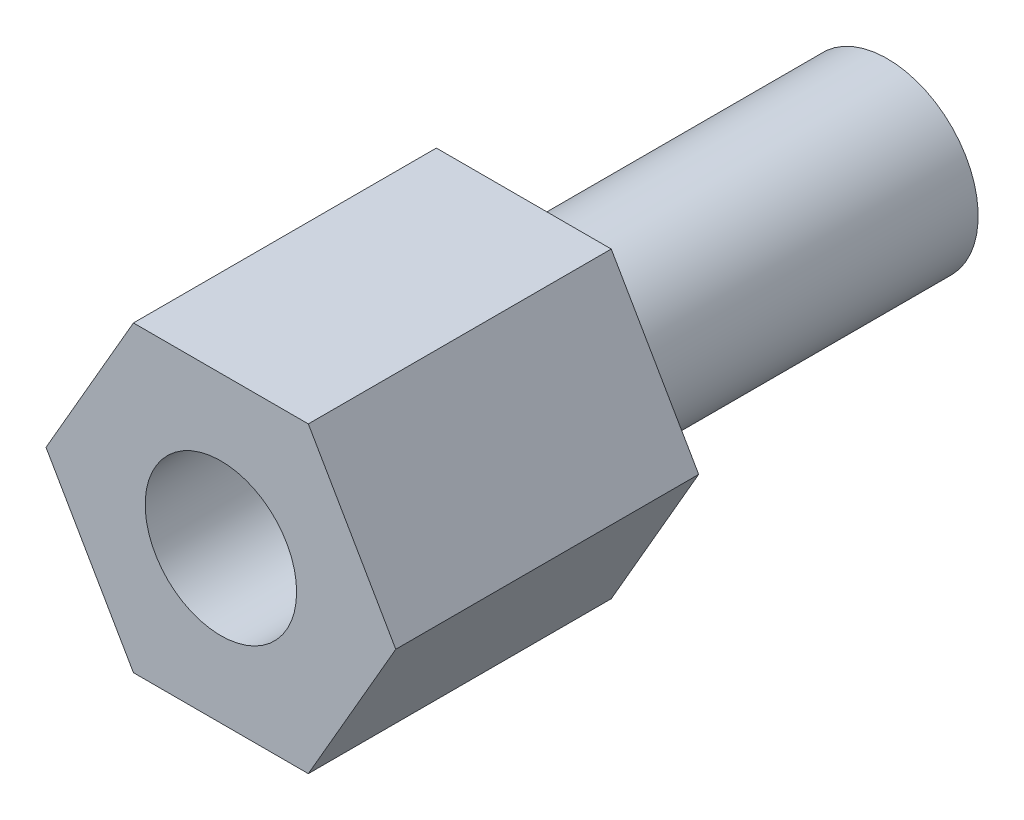
ISO-10303-21;
HEADER;
FILE_DESCRIPTION(('STEP AP214'),'2;1');
FILE_NAME('part.step','',(''),(''),'','','');
FILE_SCHEMA(('AUTOMOTIVE_DESIGN { 1 0 10303 214 1 1 1 1 }'));
ENDSEC;
DATA;
#1=APPLICATION_CONTEXT('core data for automotive mechanical design processes');
#2=APPLICATION_PROTOCOL_DEFINITION('international standard','automotive_design',2000,#1);
#3=PRODUCT_CONTEXT('',#1,'mechanical');
#4=PRODUCT('Part','Part','',(#3));
#5=PRODUCT_RELATED_PRODUCT_CATEGORY('part','',(#4));
#6=PRODUCT_DEFINITION_FORMATION('','',#4);
#7=PRODUCT_DEFINITION_CONTEXT('part definition',#1,'design');
#8=PRODUCT_DEFINITION('design','',#6,#7);
#9=PRODUCT_DEFINITION_SHAPE('','',#8);
#10=(LENGTH_UNIT() NAMED_UNIT(*) SI_UNIT(.MILLI.,.METRE.));
#11=(NAMED_UNIT(*) PLANE_ANGLE_UNIT() SI_UNIT($,.RADIAN.));
#12=(NAMED_UNIT(*) SI_UNIT($,.STERADIAN.) SOLID_ANGLE_UNIT());
#13=UNCERTAINTY_MEASURE_WITH_UNIT(LENGTH_MEASURE(1.E-05),#10,'distance_accuracy_value','');
#14=(GEOMETRIC_REPRESENTATION_CONTEXT(3) GLOBAL_UNCERTAINTY_ASSIGNED_CONTEXT((#13)) GLOBAL_UNIT_ASSIGNED_CONTEXT((#10,
#11,#12)) REPRESENTATION_CONTEXT('',''));
#15=CARTESIAN_POINT('',(0.,0.,0.));
#16=DIRECTION('',(0.,0.,1.));
#17=DIRECTION('',(1.,0.,0.));
#18=AXIS2_PLACEMENT_3D('',#15,#16,#17);
#19=CARTESIAN_POINT('',(1.44337567297406,2.5,5.));
#20=DIRECTION('',(0.,-1.,0.));
#21=DIRECTION('',(1.,0.,0.));
#22=AXIS2_PLACEMENT_3D('',#19,#20,#21);
#23=PLANE('',#22);
#24=DIRECTION('',(-1.,0.,0.));
#25=VECTOR('',#24,1.);
#26=CARTESIAN_POINT('',(1.44337567297406,2.5,0.));
#27=LINE('',#26,#25);
#28=CARTESIAN_POINT('',(1.44337567297406,2.5,0.));
#29=VERTEX_POINT('',#28);
#30=CARTESIAN_POINT('',(-1.44337567297407,2.5,0.));
#31=VERTEX_POINT('',#30);
#32=EDGE_CURVE('E124',#29,#31,#27,.T.);
#33=ORIENTED_EDGE('',*,*,#32,.T.);
#34=DIRECTION('',(0.,0.,-1.));
#35=VECTOR('',#34,1.);
#36=CARTESIAN_POINT('',(-1.44337567297407,2.5,5.));
#37=LINE('',#36,#35);
#38=CARTESIAN_POINT('',(-1.44337567297407,2.5,5.));
#39=VERTEX_POINT('',#38);
#40=EDGE_CURVE('E39',#39,#31,#37,.T.);
#41=ORIENTED_EDGE('',*,*,#40,.F.);
#42=DIRECTION('',(-1.,0.,0.));
#43=VECTOR('',#42,1.);
#44=CARTESIAN_POINT('',(1.44337567297406,2.5,5.));
#45=LINE('',#44,#43);
#46=CARTESIAN_POINT('',(1.44337567297406,2.5,5.));
#47=VERTEX_POINT('',#46);
#48=EDGE_CURVE('E135',#47,#39,#45,.T.);
#49=ORIENTED_EDGE('',*,*,#48,.F.);
#50=DIRECTION('',(0.,0.,-1.));
#51=VECTOR('',#50,1.);
#52=CARTESIAN_POINT('',(1.44337567297406,2.5,5.));
#53=LINE('',#52,#51);
#54=EDGE_CURVE('E120',#47,#29,#53,.T.);
#55=ORIENTED_EDGE('',*,*,#54,.T.);
#56=EDGE_LOOP('',(#33,#41,#49,#55));
#57=FACE_BOUND('',#56,.T.);
#58=ADVANCED_FACE('F36',(#57),#23,.F.);
#59=CARTESIAN_POINT('',(-1.44337567297407,2.5,5.));
#60=DIRECTION('',(0.866025403784439,-0.5,0.));
#61=DIRECTION('',(0.5,0.866025403784439,0.));
#62=AXIS2_PLACEMENT_3D('',#59,#60,#61);
#63=PLANE('',#62);
#64=DIRECTION('',(-0.5,-0.866025403784439,0.));
#65=VECTOR('',#64,1.);
#66=CARTESIAN_POINT('',(-1.44337567297407,2.5,0.));
#67=LINE('',#66,#65);
#68=CARTESIAN_POINT('',(-2.88675134594813,0.,0.));
#69=VERTEX_POINT('',#68);
#70=EDGE_CURVE('E127',#31,#69,#67,.T.);
#71=ORIENTED_EDGE('',*,*,#70,.T.);
#72=DIRECTION('',(0.,0.,-1.));
#73=VECTOR('',#72,1.);
#74=CARTESIAN_POINT('',(-2.88675134594813,0.,5.));
#75=LINE('',#74,#73);
#76=CARTESIAN_POINT('',(-2.88675134594813,0.,5.));
#77=VERTEX_POINT('',#76);
#78=EDGE_CURVE('E138',#77,#69,#75,.T.);
#79=ORIENTED_EDGE('',*,*,#78,.F.);
#80=DIRECTION('',(-0.5,-0.866025403784439,0.));
#81=VECTOR('',#80,1.);
#82=CARTESIAN_POINT('',(-1.44337567297407,2.5,5.));
#83=LINE('',#82,#81);
#84=EDGE_CURVE('E92',#39,#77,#83,.T.);
#85=ORIENTED_EDGE('',*,*,#84,.F.);
#86=ORIENTED_EDGE('',*,*,#40,.T.);
#87=EDGE_LOOP('',(#71,#79,#85,#86));
#88=FACE_BOUND('',#87,.T.);
#89=ADVANCED_FACE('F143',(#88),#63,.F.);
#90=CARTESIAN_POINT('',(-2.88675134594813,0.,5.));
#91=DIRECTION('',(0.866025403784438,0.5,0.));
#92=DIRECTION('',(-0.5,0.866025403784438,0.));
#93=AXIS2_PLACEMENT_3D('',#90,#91,#92);
#94=PLANE('',#93);
#95=DIRECTION('',(0.5,-0.866025403784438,0.));
#96=VECTOR('',#95,1.);
#97=CARTESIAN_POINT('',(-2.88675134594813,0.,0.));
#98=LINE('',#97,#96);
#99=CARTESIAN_POINT('',(-1.44337567297406,-2.5,0.));
#100=VERTEX_POINT('',#99);
#101=EDGE_CURVE('E130',#69,#100,#98,.T.);
#102=ORIENTED_EDGE('',*,*,#101,.T.);
#103=DIRECTION('',(0.,0.,-1.));
#104=VECTOR('',#103,1.);
#105=CARTESIAN_POINT('',(-1.44337567297406,-2.5,5.));
#106=LINE('',#105,#104);
#107=CARTESIAN_POINT('',(-1.44337567297406,-2.5,5.));
#108=VERTEX_POINT('',#107);
#109=EDGE_CURVE('E115',#108,#100,#106,.T.);
#110=ORIENTED_EDGE('',*,*,#109,.F.);
#111=DIRECTION('',(0.5,-0.866025403784438,0.));
#112=VECTOR('',#111,1.);
#113=CARTESIAN_POINT('',(-2.88675134594813,0.,5.));
#114=LINE('',#113,#112);
#115=EDGE_CURVE('E106',#77,#108,#114,.T.);
#116=ORIENTED_EDGE('',*,*,#115,.F.);
#117=ORIENTED_EDGE('',*,*,#78,.T.);
#118=EDGE_LOOP('',(#102,#110,#116,#117));
#119=FACE_BOUND('',#118,.T.);
#120=ADVANCED_FACE('F149',(#119),#94,.F.);
#121=CARTESIAN_POINT('',(-1.44337567297406,-2.5,5.));
#122=DIRECTION('',(0.,1.,0.));
#123=DIRECTION('',(-1.,0.,0.));
#124=AXIS2_PLACEMENT_3D('',#121,#122,#123);
#125=PLANE('',#124);
#126=DIRECTION('',(1.,0.,0.));
#127=VECTOR('',#126,1.);
#128=CARTESIAN_POINT('',(-1.44337567297406,-2.5,0.));
#129=LINE('',#128,#127);
#130=CARTESIAN_POINT('',(1.44337567297407,-2.5,0.));
#131=VERTEX_POINT('',#130);
#132=EDGE_CURVE('E114',#100,#131,#129,.T.);
#133=ORIENTED_EDGE('',*,*,#132,.T.);
#134=DIRECTION('',(0.,0.,-1.));
#135=VECTOR('',#134,1.);
#136=CARTESIAN_POINT('',(1.44337567297407,-2.5,5.));
#137=LINE('',#136,#135);
#138=CARTESIAN_POINT('',(1.44337567297407,-2.5,5.));
#139=VERTEX_POINT('',#138);
#140=EDGE_CURVE('E111',#139,#131,#137,.T.);
#141=ORIENTED_EDGE('',*,*,#140,.F.);
#142=DIRECTION('',(1.,0.,0.));
#143=VECTOR('',#142,1.);
#144=CARTESIAN_POINT('',(-1.44337567297406,-2.5,5.));
#145=LINE('',#144,#143);
#146=EDGE_CURVE('E100',#108,#139,#145,.T.);
#147=ORIENTED_EDGE('',*,*,#146,.F.);
#148=ORIENTED_EDGE('',*,*,#109,.T.);
#149=EDGE_LOOP('',(#133,#141,#147,#148));
#150=FACE_BOUND('',#149,.T.);
#151=ADVANCED_FACE('F112',(#150),#125,.F.);
#152=CARTESIAN_POINT('',(1.44337567297407,-2.5,5.));
#153=DIRECTION('',(-0.866025403784439,0.5,0.));
#154=DIRECTION('',(-0.5,-0.866025403784439,0.));
#155=AXIS2_PLACEMENT_3D('',#152,#153,#154);
#156=PLANE('',#155);
#157=DIRECTION('',(0.5,0.866025403784439,0.));
#158=VECTOR('',#157,1.);
#159=CARTESIAN_POINT('',(1.44337567297407,-2.5,0.));
#160=LINE('',#159,#158);
#161=CARTESIAN_POINT('',(2.88675134594813,0.,0.));
#162=VERTEX_POINT('',#161);
#163=EDGE_CURVE('E77',#131,#162,#160,.T.);
#164=ORIENTED_EDGE('',*,*,#163,.T.);
#165=DIRECTION('',(0.,0.,-1.));
#166=VECTOR('',#165,1.);
#167=CARTESIAN_POINT('',(2.88675134594813,0.,5.));
#168=LINE('',#167,#166);
#169=CARTESIAN_POINT('',(2.88675134594813,0.,5.));
#170=VERTEX_POINT('',#169);
#171=EDGE_CURVE('E116',#170,#162,#168,.T.);
#172=ORIENTED_EDGE('',*,*,#171,.F.);
#173=DIRECTION('',(0.5,0.866025403784439,0.));
#174=VECTOR('',#173,1.);
#175=CARTESIAN_POINT('',(1.44337567297407,-2.5,5.));
#176=LINE('',#175,#174);
#177=EDGE_CURVE('E104',#139,#170,#176,.T.);
#178=ORIENTED_EDGE('',*,*,#177,.F.);
#179=ORIENTED_EDGE('',*,*,#140,.T.);
#180=EDGE_LOOP('',(#164,#172,#178,#179));
#181=FACE_BOUND('',#180,.T.);
#182=ADVANCED_FACE('F118',(#181),#156,.F.);
#183=CARTESIAN_POINT('',(2.88675134594813,0.,5.));
#184=DIRECTION('',(-0.866025403784439,-0.5,0.));
#185=DIRECTION('',(0.5,-0.866025403784439,0.));
#186=AXIS2_PLACEMENT_3D('',#183,#184,#185);
#187=PLANE('',#186);
#188=DIRECTION('',(-0.5,0.866025403784439,0.));
#189=VECTOR('',#188,1.);
#190=CARTESIAN_POINT('',(2.88675134594813,0.,0.));
#191=LINE('',#190,#189);
#192=EDGE_CURVE('E83',#162,#29,#191,.T.);
#193=ORIENTED_EDGE('',*,*,#192,.T.);
#194=ORIENTED_EDGE('',*,*,#54,.F.);
#195=DIRECTION('',(-0.5,0.866025403784439,0.));
#196=VECTOR('',#195,1.);
#197=CARTESIAN_POINT('',(2.88675134594813,0.,5.));
#198=LINE('',#197,#196);
#199=EDGE_CURVE('E53',#170,#47,#198,.T.);
#200=ORIENTED_EDGE('',*,*,#199,.F.);
#201=ORIENTED_EDGE('',*,*,#171,.T.);
#202=EDGE_LOOP('',(#193,#194,#200,#201));
#203=FACE_BOUND('',#202,.T.);
#204=ADVANCED_FACE('F165',(#203),#187,.F.);
#205=CARTESIAN_POINT('',(0.,0.,5.));
#206=DIRECTION('',(0.,0.,1.));
#207=DIRECTION('',(1.,0.,0.));
#208=AXIS2_PLACEMENT_3D('',#205,#206,#207);
#209=PLANE('',#208);
#210=CARTESIAN_POINT('',(0.,0.,5.));
#211=DIRECTION('',(0.,0.,1.));
#212=DIRECTION('',(1.,0.,0.));
#213=AXIS2_PLACEMENT_3D('',#210,#211,#212);
#214=CIRCLE('',#213,1.24999999999999);
#215=CARTESIAN_POINT('',(1.24999999999999,0.,5.));
#216=VERTEX_POINT('',#215);
#217=EDGE_CURVE('E158',#216,#216,#214,.T.);
#218=ORIENTED_EDGE('',*,*,#217,.F.);
#219=EDGE_LOOP('',(#218));
#220=FACE_BOUND('',#219,.T.);
#221=ORIENTED_EDGE('',*,*,#48,.T.);
#222=ORIENTED_EDGE('',*,*,#84,.T.);
#223=ORIENTED_EDGE('',*,*,#115,.T.);
#224=ORIENTED_EDGE('',*,*,#146,.T.);
#225=ORIENTED_EDGE('',*,*,#177,.T.);
#226=ORIENTED_EDGE('',*,*,#199,.T.);
#227=EDGE_LOOP('',(#221,#222,#223,#224,#225,#226));
#228=FACE_BOUND('',#227,.T.);
#229=ADVANCED_FACE('F102',(#220,#228),#209,.T.);
#230=CARTESIAN_POINT('',(0.,0.,0.));
#231=DIRECTION('',(0.,0.,1.));
#232=DIRECTION('',(1.,0.,0.));
#233=AXIS2_PLACEMENT_3D('',#230,#231,#232);
#234=PLANE('',#233);
#235=CARTESIAN_POINT('',(0.,0.,0.));
#236=DIRECTION('',(0.,0.,-1.));
#237=DIRECTION('',(-1.,0.,0.));
#238=AXIS2_PLACEMENT_3D('',#235,#236,#237);
#239=CIRCLE('',#238,1.5);
#240=CARTESIAN_POINT('',(-1.5,0.,0.));
#241=VERTEX_POINT('',#240);
#242=EDGE_CURVE('E11',#241,#241,#239,.T.);
#243=ORIENTED_EDGE('',*,*,#242,.F.);
#244=EDGE_LOOP('',(#243));
#245=FACE_BOUND('',#244,.T.);
#246=ORIENTED_EDGE('',*,*,#32,.F.);
#247=ORIENTED_EDGE('',*,*,#192,.F.);
#248=ORIENTED_EDGE('',*,*,#163,.F.);
#249=ORIENTED_EDGE('',*,*,#132,.F.);
#250=ORIENTED_EDGE('',*,*,#101,.F.);
#251=ORIENTED_EDGE('',*,*,#70,.F.);
#252=EDGE_LOOP('',(#246,#247,#248,#249,#250,#251));
#253=FACE_BOUND('',#252,.T.);
#254=ADVANCED_FACE('F148',(#245,#253),#234,.F.);
#255=CARTESIAN_POINT('',(0.,0.,-6.));
#256=DIRECTION('',(0.,0.,1.));
#257=DIRECTION('',(1.,0.,0.));
#258=AXIS2_PLACEMENT_3D('',#255,#256,#257);
#259=CYLINDRICAL_SURFACE('',#258,1.5);
#260=CARTESIAN_POINT('',(0.,0.,-6.));
#261=DIRECTION('',(0.,0.,-1.));
#262=DIRECTION('',(-1.,0.,0.));
#263=AXIS2_PLACEMENT_3D('',#260,#261,#262);
#264=CIRCLE('',#263,1.5);
#265=CARTESIAN_POINT('',(-1.5,0.,-6.));
#266=VERTEX_POINT('',#265);
#267=EDGE_CURVE('E128',#266,#266,#264,.T.);
#268=ORIENTED_EDGE('',*,*,#267,.F.);
#269=EDGE_LOOP('',(#268));
#270=FACE_BOUND('',#269,.T.);
#271=ORIENTED_EDGE('',*,*,#242,.T.);
#272=EDGE_LOOP('',(#271));
#273=FACE_BOUND('',#272,.T.);
#274=ADVANCED_FACE('F171',(#270,#273),#259,.T.);
#275=CARTESIAN_POINT('',(0.,0.,-6.));
#276=DIRECTION('',(0.,0.,-1.));
#277=DIRECTION('',(-1.,0.,0.));
#278=AXIS2_PLACEMENT_3D('',#275,#276,#277);
#279=PLANE('',#278);
#280=ORIENTED_EDGE('',*,*,#267,.T.);
#281=EDGE_LOOP('',(#280));
#282=FACE_BOUND('',#281,.T.);
#283=ADVANCED_FACE('F212',(#282),#279,.T.);
#284=CARTESIAN_POINT('',(0.,0.,-2.5));
#285=DIRECTION('',(0.,0.,1.));
#286=DIRECTION('',(1.,0.,0.));
#287=AXIS2_PLACEMENT_3D('',#284,#285,#286);
#288=CONICAL_SURFACE('',#287,1.25,1.02974425867665);
#289=CARTESIAN_POINT('',(0.,0.,-3.25107577378445));
#290=VERTEX_POINT('',#289);
#291=VERTEX_LOOP('',#290);
#292=FACE_BOUND('',#291,.T.);
#293=CARTESIAN_POINT('',(0.,0.,-2.5));
#294=DIRECTION('',(0.,0.,1.));
#295=DIRECTION('',(1.,0.,0.));
#296=AXIS2_PLACEMENT_3D('',#293,#294,#295);
#297=CIRCLE('',#296,1.25);
#298=CARTESIAN_POINT('',(1.25,0.,-2.5));
#299=VERTEX_POINT('',#298);
#300=EDGE_CURVE('E155',#299,#299,#297,.T.);
#301=ORIENTED_EDGE('',*,*,#300,.T.);
#302=EDGE_LOOP('',(#301));
#303=FACE_BOUND('',#302,.T.);
#304=ADVANCED_FACE('F220',(#292,#303),#288,.F.);
#305=CARTESIAN_POINT('',(0.,0.,5.));
#306=DIRECTION('',(0.,0.,1.));
#307=DIRECTION('',(1.,0.,0.));
#308=AXIS2_PLACEMENT_3D('',#305,#306,#307);
#309=CYLINDRICAL_SURFACE('',#308,1.24999999999999);
#310=ORIENTED_EDGE('',*,*,#300,.F.);
#311=EDGE_LOOP('',(#310));
#312=FACE_BOUND('',#311,.T.);
#313=ORIENTED_EDGE('',*,*,#217,.T.);
#314=EDGE_LOOP('',(#313));
#315=FACE_BOUND('',#314,.T.);
#316=ADVANCED_FACE('F162',(#312,#315),#309,.F.);
#317=CLOSED_SHELL('',(#58,#89,#120,#151,#182,#204,#229,#254,#274,#283,#304,#316));
#318=MANIFOLD_SOLID_BREP('B2',#317);
#319=ADVANCED_BREP_SHAPE_REPRESENTATION('',(#18,#318),#14);
#320=SHAPE_DEFINITION_REPRESENTATION(#9,#319);
ENDSEC;
END-ISO-10303-21;
